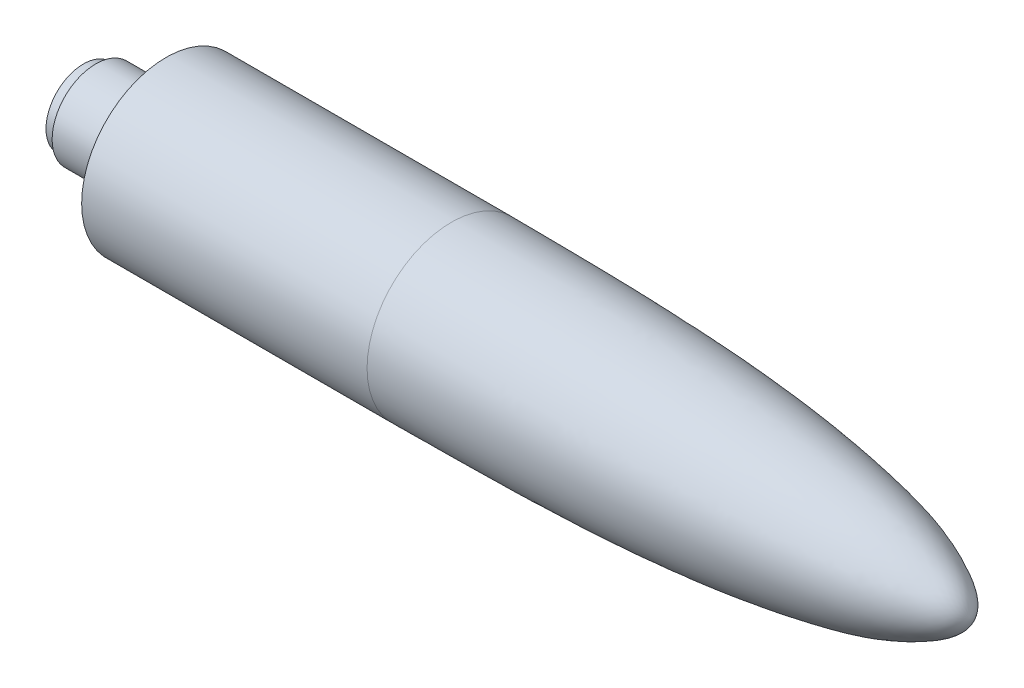
ISO-10303-21;
HEADER;
FILE_DESCRIPTION(('STEP AP214'),'2;1');
FILE_NAME('part.step','',(''),(''),'','','');
FILE_SCHEMA(('AUTOMOTIVE_DESIGN { 1 0 10303 214 1 1 1 1 }'));
ENDSEC;
DATA;
#1=APPLICATION_CONTEXT('core data for automotive mechanical design processes');
#2=APPLICATION_PROTOCOL_DEFINITION('international standard','automotive_design',2000,#1);
#3=PRODUCT_CONTEXT('',#1,'mechanical');
#4=PRODUCT('Part','Part','',(#3));
#5=PRODUCT_RELATED_PRODUCT_CATEGORY('part','',(#4));
#6=PRODUCT_DEFINITION_FORMATION('','',#4);
#7=PRODUCT_DEFINITION_CONTEXT('part definition',#1,'design');
#8=PRODUCT_DEFINITION('design','',#6,#7);
#9=PRODUCT_DEFINITION_SHAPE('','',#8);
#10=(LENGTH_UNIT() NAMED_UNIT(*) SI_UNIT(.MILLI.,.METRE.));
#11=(NAMED_UNIT(*) PLANE_ANGLE_UNIT() SI_UNIT($,.RADIAN.));
#12=(NAMED_UNIT(*) SI_UNIT($,.STERADIAN.) SOLID_ANGLE_UNIT());
#13=UNCERTAINTY_MEASURE_WITH_UNIT(LENGTH_MEASURE(1.E-05),#10,'distance_accuracy_value','');
#14=(GEOMETRIC_REPRESENTATION_CONTEXT(3) GLOBAL_UNCERTAINTY_ASSIGNED_CONTEXT((#13)) GLOBAL_UNIT_ASSIGNED_CONTEXT((#10,
#11,#12)) REPRESENTATION_CONTEXT('',''));
#15=CARTESIAN_POINT('',(0.,0.,0.));
#16=DIRECTION('',(0.,0.,1.));
#17=DIRECTION('',(1.,0.,0.));
#18=AXIS2_PLACEMENT_3D('',#15,#16,#17);
#19=CARTESIAN_POINT('',(0.,0.,0.));
#20=DIRECTION('',(-1.,0.,0.));
#21=DIRECTION('',(0.,0.,1.));
#22=AXIS2_PLACEMENT_3D('',#19,#20,#21);
#23=PLANE('',#22);
#24=CARTESIAN_POINT('',(0.,0.,0.));
#25=DIRECTION('',(-1.,0.,0.));
#26=DIRECTION('',(0.,0.,1.));
#27=AXIS2_PLACEMENT_3D('',#24,#25,#26);
#28=CIRCLE('',#27,2.44);
#29=CARTESIAN_POINT('',(0.,0.,2.44));
#30=VERTEX_POINT('',#29);
#31=EDGE_CURVE('E41',#30,#30,#28,.T.);
#32=ORIENTED_EDGE('',*,*,#31,.F.);
#33=EDGE_LOOP('',(#32));
#34=FACE_BOUND('',#33,.T.);
#35=CARTESIAN_POINT('',(0.,0.,0.));
#36=DIRECTION('',(-1.,0.,0.));
#37=DIRECTION('',(0.,0.,1.));
#38=AXIS2_PLACEMENT_3D('',#35,#36,#37);
#39=CIRCLE('',#38,6.);
#40=CARTESIAN_POINT('',(0.,0.,6.));
#41=VERTEX_POINT('',#40);
#42=EDGE_CURVE('E37',#41,#41,#39,.T.);
#43=ORIENTED_EDGE('',*,*,#42,.T.);
#44=EDGE_LOOP('',(#43));
#45=FACE_BOUND('',#44,.T.);
#46=ADVANCED_FACE('F34',(#34,#45),#23,.T.);
#47=CARTESIAN_POINT('',(0.,0.,0.));
#48=DIRECTION('',(-1.,0.,0.));
#49=DIRECTION('',(0.,0.,1.));
#50=AXIS2_PLACEMENT_3D('',#47,#48,#49);
#51=CYLINDRICAL_SURFACE('',#50,6.);
#52=CARTESIAN_POINT('',(20.3,0.,0.));
#53=DIRECTION('',(-1.,0.,0.));
#54=DIRECTION('',(0.,0.,1.));
#55=AXIS2_PLACEMENT_3D('',#52,#53,#54);
#56=CIRCLE('',#55,6.);
#57=CARTESIAN_POINT('',(20.3,0.,6.));
#58=VERTEX_POINT('',#57);
#59=EDGE_CURVE('E53',#58,#58,#56,.T.);
#60=ORIENTED_EDGE('',*,*,#59,.T.);
#61=EDGE_LOOP('',(#60));
#62=FACE_BOUND('',#61,.T.);
#63=ORIENTED_EDGE('',*,*,#42,.F.);
#64=EDGE_LOOP('',(#63));
#65=FACE_BOUND('',#64,.T.);
#66=ADVANCED_FACE('F49',(#62,#65),#51,.T.);
#67=CARTESIAN_POINT('',(20.3,0.,6.));
#68=CARTESIAN_POINT('',(29.63749830406,0.,5.93693234132475));
#69=CARTESIAN_POINT('',(42.0157193429363,0.,5.94197228177759));
#70=CARTESIAN_POINT('',(53.939810571496,0.,3.01806891682829));
#71=CARTESIAN_POINT('',(57.0100389619626,0.,1.04718188014026));
#72=CARTESIAN_POINT('',(57.2015269241124,0.,0.070177054506609));
#73=CARTESIAN_POINT('',(57.2,0.,0.));
#74=B_SPLINE_CURVE_WITH_KNOTS('',3,(#67,#68,#69,#70,#71,#72,#73),.UNSPECIFIED.,.F.,.F.,(4,1,1,1,
4),(0.,0.749116830441751,0.922480950291814,0.994604009271438,1.),.UNSPECIFIED.);
#75=CARTESIAN_POINT('',(0.,0.,0.));
#76=DIRECTION('',(-1.,0.,0.));
#77=AXIS1_PLACEMENT('',#75,#76);
#78=SURFACE_OF_REVOLUTION('',#74,#77);
#79=CARTESIAN_POINT('',(57.2,0.,0.));
#80=VERTEX_POINT('',#79);
#81=VERTEX_LOOP('',#80);
#82=FACE_BOUND('',#81,.T.);
#83=ORIENTED_EDGE('',*,*,#59,.F.);
#84=EDGE_LOOP('',(#83));
#85=FACE_BOUND('',#84,.T.);
#86=ADVANCED_FACE('F45',(#82,#85),#78,.F.);
#87=CARTESIAN_POINT('',(-1.5,0.,0.));
#88=DIRECTION('',(1.,0.,0.));
#89=DIRECTION('',(0.,0.,-1.));
#90=AXIS2_PLACEMENT_3D('',#87,#88,#89);
#91=CYLINDRICAL_SURFACE('',#90,2.44);
#92=CARTESIAN_POINT('',(-1.5,0.,0.));
#93=DIRECTION('',(-1.,0.,0.));
#94=DIRECTION('',(0.,0.,1.));
#95=AXIS2_PLACEMENT_3D('',#92,#93,#94);
#96=CIRCLE('',#95,2.44);
#97=CARTESIAN_POINT('',(-1.5,0.,2.44));
#98=VERTEX_POINT('',#97);
#99=EDGE_CURVE('E55',#98,#98,#96,.T.);
#100=ORIENTED_EDGE('',*,*,#99,.F.);
#101=EDGE_LOOP('',(#100));
#102=FACE_BOUND('',#101,.T.);
#103=ORIENTED_EDGE('',*,*,#31,.T.);
#104=EDGE_LOOP('',(#103));
#105=FACE_BOUND('',#104,.T.);
#106=ADVANCED_FACE('F48',(#102,#105),#91,.T.);
#107=CARTESIAN_POINT('',(-5.,0.,0.));
#108=DIRECTION('',(1.,0.,0.));
#109=DIRECTION('',(0.,0.,-1.));
#110=AXIS2_PLACEMENT_3D('',#107,#108,#109);
#111=CYLINDRICAL_SURFACE('',#110,3.1);
#112=CARTESIAN_POINT('',(-5.,0.,0.));
#113=DIRECTION('',(-1.,0.,0.));
#114=DIRECTION('',(0.,0.,1.));
#115=AXIS2_PLACEMENT_3D('',#112,#113,#114);
#116=CIRCLE('',#115,3.1);
#117=CARTESIAN_POINT('',(-5.,0.,3.1));
#118=VERTEX_POINT('',#117);
#119=EDGE_CURVE('E58',#118,#118,#116,.T.);
#120=ORIENTED_EDGE('',*,*,#119,.F.);
#121=EDGE_LOOP('',(#120));
#122=FACE_BOUND('',#121,.T.);
#123=CARTESIAN_POINT('',(-1.5,0.,0.));
#124=DIRECTION('',(-1.,0.,0.));
#125=DIRECTION('',(0.,0.,1.));
#126=AXIS2_PLACEMENT_3D('',#123,#124,#125);
#127=CIRCLE('',#126,3.1);
#128=CARTESIAN_POINT('',(-1.5,0.,3.1));
#129=VERTEX_POINT('',#128);
#130=EDGE_CURVE('E100',#129,#129,#127,.T.);
#131=ORIENTED_EDGE('',*,*,#130,.T.);
#132=EDGE_LOOP('',(#131));
#133=FACE_BOUND('',#132,.T.);
#134=ADVANCED_FACE('F84',(#122,#133),#111,.T.);
#135=CARTESIAN_POINT('',(-5.,0.,0.));
#136=DIRECTION('',(-1.,0.,0.));
#137=DIRECTION('',(0.,0.,1.));
#138=AXIS2_PLACEMENT_3D('',#135,#136,#137);
#139=PLANE('',#138);
#140=CARTESIAN_POINT('',(-5.,0.,0.));
#141=DIRECTION('',(-1.,0.,0.));
#142=DIRECTION('',(0.,0.,1.));
#143=AXIS2_PLACEMENT_3D('',#140,#141,#142);
#144=CIRCLE('',#143,2.665);
#145=CARTESIAN_POINT('',(-5.,0.,2.665));
#146=VERTEX_POINT('',#145);
#147=EDGE_CURVE('E11',#146,#146,#144,.T.);
#148=ORIENTED_EDGE('',*,*,#147,.F.);
#149=EDGE_LOOP('',(#148));
#150=FACE_BOUND('',#149,.T.);
#151=ORIENTED_EDGE('',*,*,#119,.T.);
#152=EDGE_LOOP('',(#151));
#153=FACE_BOUND('',#152,.T.);
#154=ADVANCED_FACE('F89',(#150,#153),#139,.T.);
#155=CARTESIAN_POINT('',(-1.5,0.,0.));
#156=DIRECTION('',(-1.,0.,0.));
#157=DIRECTION('',(0.,0.,1.));
#158=AXIS2_PLACEMENT_3D('',#155,#156,#157);
#159=PLANE('',#158);
#160=ORIENTED_EDGE('',*,*,#99,.T.);
#161=EDGE_LOOP('',(#160));
#162=FACE_BOUND('',#161,.T.);
#163=ORIENTED_EDGE('',*,*,#130,.F.);
#164=EDGE_LOOP('',(#163));
#165=FACE_BOUND('',#164,.T.);
#166=ADVANCED_FACE('F93',(#162,#165),#159,.F.);
#167=CARTESIAN_POINT('',(-5.87,0.,0.));
#168=DIRECTION('',(1.,0.,0.));
#169=DIRECTION('',(0.,0.,-1.));
#170=AXIS2_PLACEMENT_3D('',#167,#168,#169);
#171=CYLINDRICAL_SURFACE('',#170,2.665);
#172=CARTESIAN_POINT('',(-5.87,0.,0.));
#173=DIRECTION('',(-1.,0.,0.));
#174=DIRECTION('',(0.,0.,1.));
#175=AXIS2_PLACEMENT_3D('',#172,#173,#174);
#176=CIRCLE('',#175,2.665);
#177=CARTESIAN_POINT('',(-5.87,0.,2.665));
#178=VERTEX_POINT('',#177);
#179=EDGE_CURVE('E102',#178,#178,#176,.T.);
#180=ORIENTED_EDGE('',*,*,#179,.F.);
#181=EDGE_LOOP('',(#180));
#182=FACE_BOUND('',#181,.T.);
#183=ORIENTED_EDGE('',*,*,#147,.T.);
#184=EDGE_LOOP('',(#183));
#185=FACE_BOUND('',#184,.T.);
#186=ADVANCED_FACE('F96',(#182,#185),#171,.T.);
#187=CARTESIAN_POINT('',(-5.87,0.,0.));
#188=DIRECTION('',(-1.,0.,0.));
#189=DIRECTION('',(0.,0.,1.));
#190=AXIS2_PLACEMENT_3D('',#187,#188,#189);
#191=PLANE('',#190);
#192=ORIENTED_EDGE('',*,*,#179,.T.);
#193=EDGE_LOOP('',(#192));
#194=FACE_BOUND('',#193,.T.);
#195=ADVANCED_FACE('F110',(#194),#191,.T.);
#196=CLOSED_SHELL('',(#46,#66,#86,#106,#134,#154,#166,#186,#195));
#197=MANIFOLD_SOLID_BREP('B2',#196);
#198=ADVANCED_BREP_SHAPE_REPRESENTATION('',(#18,#197),#14);
#199=SHAPE_DEFINITION_REPRESENTATION(#9,#198);
ENDSEC;
END-ISO-10303-21;
